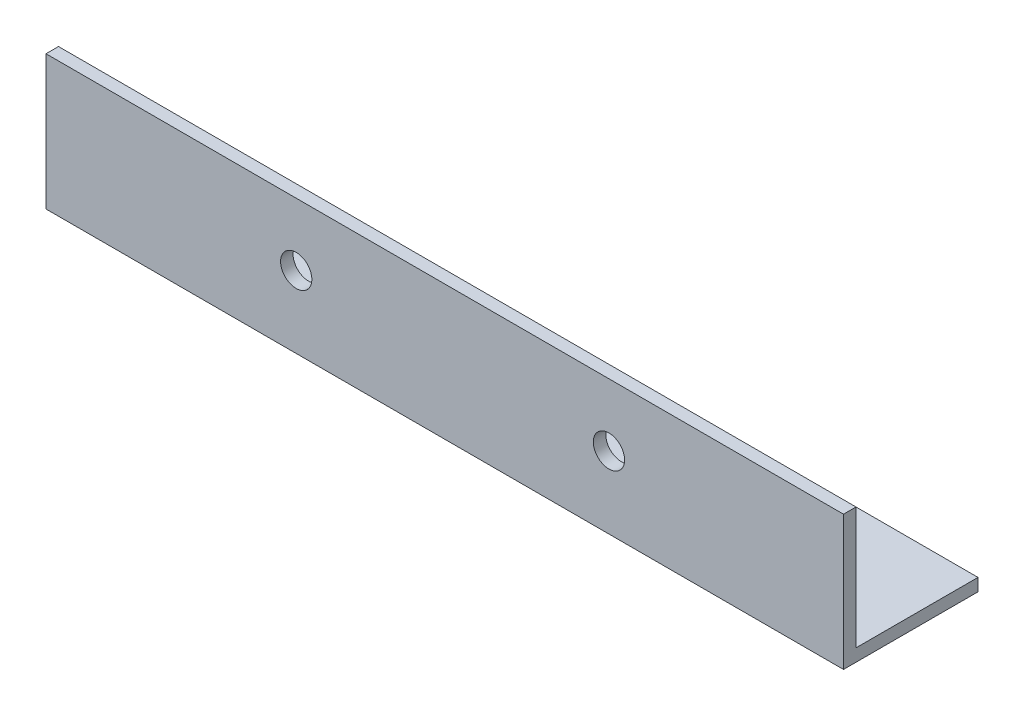
ISO-10303-21;
HEADER;
FILE_DESCRIPTION(('STEP AP214'),'2;1');
FILE_NAME('part.step','',(''),(''),'','','');
FILE_SCHEMA(('AUTOMOTIVE_DESIGN { 1 0 10303 214 1 1 1 1 }'));
ENDSEC;
DATA;
#1=APPLICATION_CONTEXT('core data for automotive mechanical design processes');
#2=APPLICATION_PROTOCOL_DEFINITION('international standard','automotive_design',2000,#1);
#3=PRODUCT_CONTEXT('',#1,'mechanical');
#4=PRODUCT('Part','Part','',(#3));
#5=PRODUCT_RELATED_PRODUCT_CATEGORY('part','',(#4));
#6=PRODUCT_DEFINITION_FORMATION('','',#4);
#7=PRODUCT_DEFINITION_CONTEXT('part definition',#1,'design');
#8=PRODUCT_DEFINITION('design','',#6,#7);
#9=PRODUCT_DEFINITION_SHAPE('','',#8);
#10=(LENGTH_UNIT() NAMED_UNIT(*) SI_UNIT(.MILLI.,.METRE.));
#11=(NAMED_UNIT(*) PLANE_ANGLE_UNIT() SI_UNIT($,.RADIAN.));
#12=(NAMED_UNIT(*) SI_UNIT($,.STERADIAN.) SOLID_ANGLE_UNIT());
#13=UNCERTAINTY_MEASURE_WITH_UNIT(LENGTH_MEASURE(1.E-05),#10,'distance_accuracy_value','');
#14=(GEOMETRIC_REPRESENTATION_CONTEXT(3) GLOBAL_UNCERTAINTY_ASSIGNED_CONTEXT((#13)) GLOBAL_UNIT_ASSIGNED_CONTEXT((#10,
#11,#12)) REPRESENTATION_CONTEXT('',''));
#15=CARTESIAN_POINT('',(0.,0.,0.));
#16=DIRECTION('',(0.,0.,1.));
#17=DIRECTION('',(1.,0.,0.));
#18=AXIS2_PLACEMENT_3D('',#15,#16,#17);
#19=CARTESIAN_POINT('',(255.,0.,0.));
#20=DIRECTION('',(0.,1.,0.));
#21=DIRECTION('',(0.,0.,1.));
#22=AXIS2_PLACEMENT_3D('',#19,#20,#21);
#23=PLANE('',#22);
#24=DIRECTION('',(0.,0.,-1.));
#25=VECTOR('',#24,1.);
#26=CARTESIAN_POINT('',(0.,0.,0.));
#27=LINE('',#26,#25);
#28=CARTESIAN_POINT('',(0.,0.,0.));
#29=VERTEX_POINT('',#28);
#30=CARTESIAN_POINT('',(0.,0.,-43.));
#31=VERTEX_POINT('',#30);
#32=EDGE_CURVE('E115',#29,#31,#27,.T.);
#33=ORIENTED_EDGE('',*,*,#32,.T.);
#34=DIRECTION('',(-1.,0.,0.));
#35=VECTOR('',#34,1.);
#36=CARTESIAN_POINT('',(255.,0.,-43.));
#37=LINE('',#36,#35);
#38=CARTESIAN_POINT('',(255.,0.,-43.));
#39=VERTEX_POINT('',#38);
#40=EDGE_CURVE('E11',#39,#31,#37,.T.);
#41=ORIENTED_EDGE('',*,*,#40,.F.);
#42=DIRECTION('',(0.,0.,-1.));
#43=VECTOR('',#42,1.);
#44=CARTESIAN_POINT('',(255.,0.,0.));
#45=LINE('',#44,#43);
#46=CARTESIAN_POINT('',(255.,0.,0.));
#47=VERTEX_POINT('',#46);
#48=EDGE_CURVE('E80',#47,#39,#45,.T.);
#49=ORIENTED_EDGE('',*,*,#48,.F.);
#50=DIRECTION('',(-1.,0.,0.));
#51=VECTOR('',#50,1.);
#52=CARTESIAN_POINT('',(255.,0.,0.));
#53=LINE('',#52,#51);
#54=EDGE_CURVE('E111',#47,#29,#53,.T.);
#55=ORIENTED_EDGE('',*,*,#54,.T.);
#56=EDGE_LOOP('',(#33,#41,#49,#55));
#57=FACE_BOUND('',#56,.T.);
#58=ADVANCED_FACE('F34',(#57),#23,.F.);
#59=CARTESIAN_POINT('',(255.,4.,-43.));
#60=DIRECTION('',(0.,0.,-1.));
#61=DIRECTION('',(-1.,0.,0.));
#62=AXIS2_PLACEMENT_3D('',#59,#60,#61);
#63=PLANE('',#62);
#64=DIRECTION('',(0.,-1.,0.));
#65=VECTOR('',#64,1.);
#66=CARTESIAN_POINT('',(0.,4.,-43.));
#67=LINE('',#66,#65);
#68=CARTESIAN_POINT('',(0.,4.,-43.));
#69=VERTEX_POINT('',#68);
#70=EDGE_CURVE('E118',#69,#31,#67,.T.);
#71=ORIENTED_EDGE('',*,*,#70,.F.);
#72=DIRECTION('',(-1.,0.,0.));
#73=VECTOR('',#72,1.);
#74=CARTESIAN_POINT('',(255.,4.,-43.));
#75=LINE('',#74,#73);
#76=CARTESIAN_POINT('',(255.,4.,-43.));
#77=VERTEX_POINT('',#76);
#78=EDGE_CURVE('E42',#77,#69,#75,.T.);
#79=ORIENTED_EDGE('',*,*,#78,.F.);
#80=DIRECTION('',(0.,-1.,0.));
#81=VECTOR('',#80,1.);
#82=CARTESIAN_POINT('',(255.,4.,-43.));
#83=LINE('',#82,#81);
#84=EDGE_CURVE('E182',#77,#39,#83,.T.);
#85=ORIENTED_EDGE('',*,*,#84,.T.);
#86=ORIENTED_EDGE('',*,*,#40,.T.);
#87=EDGE_LOOP('',(#71,#79,#85,#86));
#88=FACE_BOUND('',#87,.T.);
#89=ADVANCED_FACE('F137',(#88),#63,.T.);
#90=CARTESIAN_POINT('',(255.,4.,0.));
#91=DIRECTION('',(0.,1.,0.));
#92=DIRECTION('',(0.,0.,1.));
#93=AXIS2_PLACEMENT_3D('',#90,#91,#92);
#94=PLANE('',#93);
#95=DIRECTION('',(0.,0.,-1.));
#96=VECTOR('',#95,1.);
#97=CARTESIAN_POINT('',(0.,4.,0.));
#98=LINE('',#97,#96);
#99=CARTESIAN_POINT('',(0.,4.,-4.));
#100=VERTEX_POINT('',#99);
#101=EDGE_CURVE('E122',#100,#69,#98,.T.);
#102=ORIENTED_EDGE('',*,*,#101,.F.);
#103=DIRECTION('',(-1.,0.,0.));
#104=VECTOR('',#103,1.);
#105=CARTESIAN_POINT('',(255.,4.,-4.));
#106=LINE('',#105,#104);
#107=CARTESIAN_POINT('',(255.,4.,-4.));
#108=VERTEX_POINT('',#107);
#109=EDGE_CURVE('E101',#108,#100,#106,.T.);
#110=ORIENTED_EDGE('',*,*,#109,.F.);
#111=DIRECTION('',(0.,0.,-1.));
#112=VECTOR('',#111,1.);
#113=CARTESIAN_POINT('',(255.,4.,0.));
#114=LINE('',#113,#112);
#115=EDGE_CURVE('E107',#108,#77,#114,.T.);
#116=ORIENTED_EDGE('',*,*,#115,.T.);
#117=ORIENTED_EDGE('',*,*,#78,.T.);
#118=EDGE_LOOP('',(#102,#110,#116,#117));
#119=FACE_BOUND('',#118,.T.);
#120=ADVANCED_FACE('F134',(#119),#94,.T.);
#121=CARTESIAN_POINT('',(255.,43.,-4.));
#122=DIRECTION('',(0.,0.,-1.));
#123=DIRECTION('',(0.,1.,0.));
#124=AXIS2_PLACEMENT_3D('',#121,#122,#123);
#125=PLANE('',#124);
#126=CARTESIAN_POINT('',(180.,23.,-4.));
#127=DIRECTION('',(0.,0.,-1.));
#128=DIRECTION('',(0.,1.,0.));
#129=AXIS2_PLACEMENT_3D('',#126,#127,#128);
#130=CIRCLE('',#129,4.99999999999999);
#131=CARTESIAN_POINT('',(180.,28.,-4.));
#132=VERTEX_POINT('',#131);
#133=EDGE_CURVE('E171',#132,#132,#130,.T.);
#134=ORIENTED_EDGE('',*,*,#133,.F.);
#135=EDGE_LOOP('',(#134));
#136=FACE_BOUND('',#135,.T.);
#137=CARTESIAN_POINT('',(80.,23.,-4.));
#138=DIRECTION('',(0.,0.,-1.));
#139=DIRECTION('',(0.,1.,0.));
#140=AXIS2_PLACEMENT_3D('',#137,#138,#139);
#141=CIRCLE('',#140,5.);
#142=CARTESIAN_POINT('',(80.,28.,-4.));
#143=VERTEX_POINT('',#142);
#144=EDGE_CURVE('E119',#143,#143,#141,.T.);
#145=ORIENTED_EDGE('',*,*,#144,.F.);
#146=EDGE_LOOP('',(#145));
#147=FACE_BOUND('',#146,.T.);
#148=DIRECTION('',(0.,-1.,0.));
#149=VECTOR('',#148,1.);
#150=CARTESIAN_POINT('',(0.,43.,-4.));
#151=LINE('',#150,#149);
#152=CARTESIAN_POINT('',(0.,43.,-4.));
#153=VERTEX_POINT('',#152);
#154=EDGE_CURVE('E96',#153,#100,#151,.T.);
#155=ORIENTED_EDGE('',*,*,#154,.F.);
#156=DIRECTION('',(-1.,0.,0.));
#157=VECTOR('',#156,1.);
#158=CARTESIAN_POINT('',(255.,43.,-4.));
#159=LINE('',#158,#157);
#160=CARTESIAN_POINT('',(255.,43.,-4.));
#161=VERTEX_POINT('',#160);
#162=EDGE_CURVE('E91',#161,#153,#159,.T.);
#163=ORIENTED_EDGE('',*,*,#162,.F.);
#164=DIRECTION('',(0.,-1.,0.));
#165=VECTOR('',#164,1.);
#166=CARTESIAN_POINT('',(255.,43.,-4.));
#167=LINE('',#166,#165);
#168=EDGE_CURVE('E94',#161,#108,#167,.T.);
#169=ORIENTED_EDGE('',*,*,#168,.T.);
#170=ORIENTED_EDGE('',*,*,#109,.T.);
#171=EDGE_LOOP('',(#155,#163,#169,#170));
#172=FACE_BOUND('',#171,.T.);
#173=ADVANCED_FACE('F93',(#136,#147,#172),#125,.T.);
#174=CARTESIAN_POINT('',(255.,43.,0.));
#175=DIRECTION('',(0.,1.,0.));
#176=DIRECTION('',(0.,0.,1.));
#177=AXIS2_PLACEMENT_3D('',#174,#175,#176);
#178=PLANE('',#177);
#179=DIRECTION('',(0.,0.,-1.));
#180=VECTOR('',#179,1.);
#181=CARTESIAN_POINT('',(0.,43.,0.));
#182=LINE('',#181,#180);
#183=CARTESIAN_POINT('',(0.,43.,0.));
#184=VERTEX_POINT('',#183);
#185=EDGE_CURVE('E126',#184,#153,#182,.T.);
#186=ORIENTED_EDGE('',*,*,#185,.F.);
#187=DIRECTION('',(-1.,0.,0.));
#188=VECTOR('',#187,1.);
#189=CARTESIAN_POINT('',(255.,43.,0.));
#190=LINE('',#189,#188);
#191=CARTESIAN_POINT('',(255.,43.,0.));
#192=VERTEX_POINT('',#191);
#193=EDGE_CURVE('E71',#192,#184,#190,.T.);
#194=ORIENTED_EDGE('',*,*,#193,.F.);
#195=DIRECTION('',(0.,0.,-1.));
#196=VECTOR('',#195,1.);
#197=CARTESIAN_POINT('',(255.,43.,0.));
#198=LINE('',#197,#196);
#199=EDGE_CURVE('E105',#192,#161,#198,.T.);
#200=ORIENTED_EDGE('',*,*,#199,.T.);
#201=ORIENTED_EDGE('',*,*,#162,.T.);
#202=EDGE_LOOP('',(#186,#194,#200,#201));
#203=FACE_BOUND('',#202,.T.);
#204=ADVANCED_FACE('F109',(#203),#178,.T.);
#205=CARTESIAN_POINT('',(255.,43.,0.));
#206=DIRECTION('',(0.,0.,-1.));
#207=DIRECTION('',(0.,1.,0.));
#208=AXIS2_PLACEMENT_3D('',#205,#206,#207);
#209=PLANE('',#208);
#210=CARTESIAN_POINT('',(180.,23.,0.));
#211=DIRECTION('',(0.,0.,1.));
#212=DIRECTION('',(1.,0.,0.));
#213=AXIS2_PLACEMENT_3D('',#210,#211,#212);
#214=CIRCLE('',#213,4.99999999999999);
#215=CARTESIAN_POINT('',(185.,23.,0.));
#216=VERTEX_POINT('',#215);
#217=EDGE_CURVE('E184',#216,#216,#214,.T.);
#218=ORIENTED_EDGE('',*,*,#217,.F.);
#219=EDGE_LOOP('',(#218));
#220=FACE_BOUND('',#219,.T.);
#221=CARTESIAN_POINT('',(80.,23.,0.));
#222=DIRECTION('',(0.,0.,1.));
#223=DIRECTION('',(1.,0.,0.));
#224=AXIS2_PLACEMENT_3D('',#221,#222,#223);
#225=CIRCLE('',#224,5.);
#226=CARTESIAN_POINT('',(85.,23.,0.));
#227=VERTEX_POINT('',#226);
#228=EDGE_CURVE('E175',#227,#227,#225,.T.);
#229=ORIENTED_EDGE('',*,*,#228,.F.);
#230=EDGE_LOOP('',(#229));
#231=FACE_BOUND('',#230,.T.);
#232=DIRECTION('',(0.,-1.,0.));
#233=VECTOR('',#232,1.);
#234=CARTESIAN_POINT('',(0.,43.,0.));
#235=LINE('',#234,#233);
#236=EDGE_CURVE('E74',#184,#29,#235,.T.);
#237=ORIENTED_EDGE('',*,*,#236,.T.);
#238=ORIENTED_EDGE('',*,*,#54,.F.);
#239=DIRECTION('',(0.,-1.,0.));
#240=VECTOR('',#239,1.);
#241=CARTESIAN_POINT('',(255.,43.,0.));
#242=LINE('',#241,#240);
#243=EDGE_CURVE('E50',#192,#47,#242,.T.);
#244=ORIENTED_EDGE('',*,*,#243,.F.);
#245=ORIENTED_EDGE('',*,*,#193,.T.);
#246=EDGE_LOOP('',(#237,#238,#244,#245));
#247=FACE_BOUND('',#246,.T.);
#248=ADVANCED_FACE('F142',(#220,#231,#247),#209,.F.);
#249=CARTESIAN_POINT('',(255.,0.,0.));
#250=DIRECTION('',(-1.,0.,0.));
#251=DIRECTION('',(0.,0.,1.));
#252=AXIS2_PLACEMENT_3D('',#249,#250,#251);
#253=PLANE('',#252);
#254=ORIENTED_EDGE('',*,*,#48,.T.);
#255=ORIENTED_EDGE('',*,*,#84,.F.);
#256=ORIENTED_EDGE('',*,*,#115,.F.);
#257=ORIENTED_EDGE('',*,*,#168,.F.);
#258=ORIENTED_EDGE('',*,*,#199,.F.);
#259=ORIENTED_EDGE('',*,*,#243,.T.);
#260=EDGE_LOOP('',(#254,#255,#256,#257,#258,#259));
#261=FACE_BOUND('',#260,.T.);
#262=ADVANCED_FACE('F104',(#261),#253,.F.);
#263=CARTESIAN_POINT('',(0.,0.,0.));
#264=DIRECTION('',(-1.,0.,0.));
#265=DIRECTION('',(0.,0.,1.));
#266=AXIS2_PLACEMENT_3D('',#263,#264,#265);
#267=PLANE('',#266);
#268=ORIENTED_EDGE('',*,*,#32,.F.);
#269=ORIENTED_EDGE('',*,*,#236,.F.);
#270=ORIENTED_EDGE('',*,*,#185,.T.);
#271=ORIENTED_EDGE('',*,*,#154,.T.);
#272=ORIENTED_EDGE('',*,*,#101,.T.);
#273=ORIENTED_EDGE('',*,*,#70,.T.);
#274=EDGE_LOOP('',(#268,#269,#270,#271,#272,#273));
#275=FACE_BOUND('',#274,.T.);
#276=ADVANCED_FACE('F140',(#275),#267,.T.);
#277=CARTESIAN_POINT('',(80.,23.,-43.));
#278=DIRECTION('',(0.,0.,1.));
#279=DIRECTION('',(1.,0.,0.));
#280=AXIS2_PLACEMENT_3D('',#277,#278,#279);
#281=CYLINDRICAL_SURFACE('',#280,5.);
#282=ORIENTED_EDGE('',*,*,#144,.T.);
#283=EDGE_LOOP('',(#282));
#284=FACE_BOUND('',#283,.T.);
#285=ORIENTED_EDGE('',*,*,#228,.T.);
#286=EDGE_LOOP('',(#285));
#287=FACE_BOUND('',#286,.T.);
#288=ADVANCED_FACE('F189',(#284,#287),#281,.F.);
#289=CARTESIAN_POINT('',(180.,23.,-43.));
#290=DIRECTION('',(0.,0.,1.));
#291=DIRECTION('',(1.,0.,0.));
#292=AXIS2_PLACEMENT_3D('',#289,#290,#291);
#293=CYLINDRICAL_SURFACE('',#292,4.99999999999999);
#294=ORIENTED_EDGE('',*,*,#133,.T.);
#295=EDGE_LOOP('',(#294));
#296=FACE_BOUND('',#295,.T.);
#297=ORIENTED_EDGE('',*,*,#217,.T.);
#298=EDGE_LOOP('',(#297));
#299=FACE_BOUND('',#298,.T.);
#300=ADVANCED_FACE('F187',(#296,#299),#293,.F.);
#301=CLOSED_SHELL('',(#58,#89,#120,#173,#204,#248,#262,#276,#288,#300));
#302=MANIFOLD_SOLID_BREP('B2',#301);
#303=ADVANCED_BREP_SHAPE_REPRESENTATION('',(#18,#302),#14);
#304=SHAPE_DEFINITION_REPRESENTATION(#9,#303);
ENDSEC;
END-ISO-10303-21;
